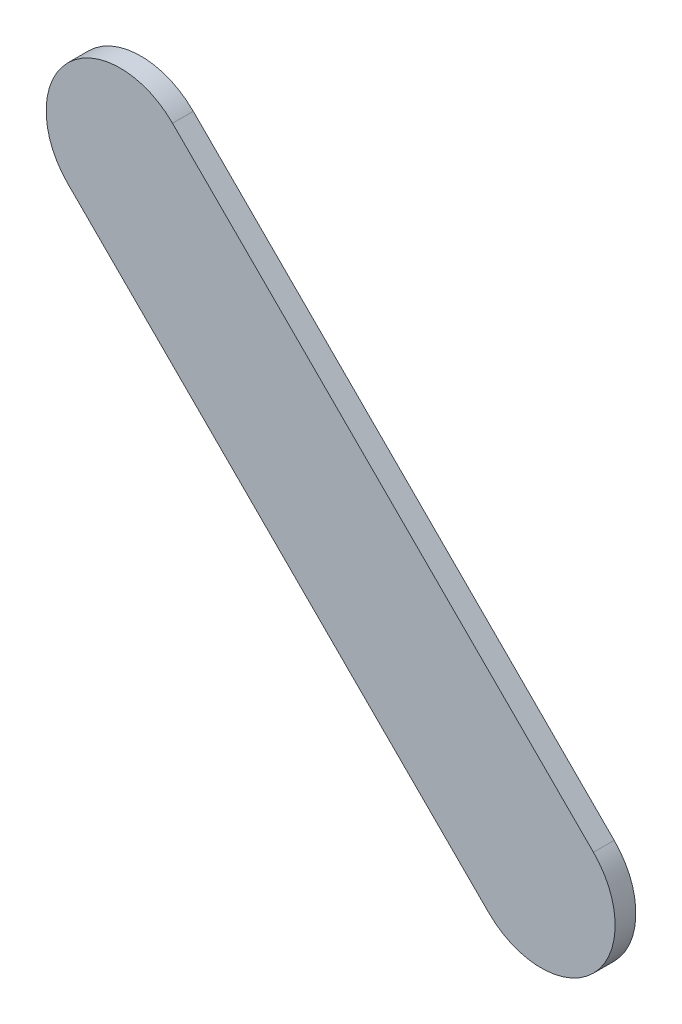
ISO-10303-21;
HEADER;
FILE_DESCRIPTION(('STEP AP214'),'2;1');
FILE_NAME('part.step','',(''),(''),'','','');
FILE_SCHEMA(('AUTOMOTIVE_DESIGN { 1 0 10303 214 1 1 1 1 }'));
ENDSEC;
DATA;
#1=APPLICATION_CONTEXT('core data for automotive mechanical design processes');
#2=APPLICATION_PROTOCOL_DEFINITION('international standard','automotive_design',2000,#1);
#3=PRODUCT_CONTEXT('',#1,'mechanical');
#4=PRODUCT('Part','Part','',(#3));
#5=PRODUCT_RELATED_PRODUCT_CATEGORY('part','',(#4));
#6=PRODUCT_DEFINITION_FORMATION('','',#4);
#7=PRODUCT_DEFINITION_CONTEXT('part definition',#1,'design');
#8=PRODUCT_DEFINITION('design','',#6,#7);
#9=PRODUCT_DEFINITION_SHAPE('','',#8);
#10=(LENGTH_UNIT() NAMED_UNIT(*) SI_UNIT(.MILLI.,.METRE.));
#11=(NAMED_UNIT(*) PLANE_ANGLE_UNIT() SI_UNIT($,.RADIAN.));
#12=(NAMED_UNIT(*) SI_UNIT($,.STERADIAN.) SOLID_ANGLE_UNIT());
#13=UNCERTAINTY_MEASURE_WITH_UNIT(LENGTH_MEASURE(1.E-05),#10,'distance_accuracy_value','');
#14=(GEOMETRIC_REPRESENTATION_CONTEXT(3) GLOBAL_UNCERTAINTY_ASSIGNED_CONTEXT((#13)) GLOBAL_UNIT_ASSIGNED_CONTEXT((#10,
#11,#12)) REPRESENTATION_CONTEXT('',''));
#15=CARTESIAN_POINT('',(0.,0.,0.));
#16=DIRECTION('',(0.,0.,1.));
#17=DIRECTION('',(1.,0.,0.));
#18=AXIS2_PLACEMENT_3D('',#15,#16,#17);
#19=CARTESIAN_POINT('',(81.40515088,68.56922532,0.));
#20=DIRECTION('',(0.707106781186548,0.707106781186548,0.));
#21=DIRECTION('',(0.707106781186548,-0.707106781186548,0.));
#22=AXIS2_PLACEMENT_3D('',#19,#20,#21);
#23=PLANE('',#22);
#24=DIRECTION('',(0.707106781186548,-0.707106781186548,0.));
#25=VECTOR('',#24,1.);
#26=CARTESIAN_POINT('',(81.40515088,68.56922532,0.03556));
#27=LINE('',#26,#25);
#28=CARTESIAN_POINT('',(81.40515088,68.56922532,0.03556));
#29=VERTEX_POINT('',#28);
#30=CARTESIAN_POINT('',(82.1271535,67.8472227,0.03556));
#31=VERTEX_POINT('',#30);
#32=EDGE_CURVE('E11',#29,#31,#27,.T.);
#33=ORIENTED_EDGE('',*,*,#32,.F.);
#34=DIRECTION('',(0.,0.,1.));
#35=VECTOR('',#34,1.);
#36=CARTESIAN_POINT('',(81.40515088,68.56922532,0.));
#37=LINE('',#36,#35);
#38=CARTESIAN_POINT('',(81.40515088,68.56922532,0.));
#39=VERTEX_POINT('',#38);
#40=EDGE_CURVE('E24',#39,#29,#37,.T.);
#41=ORIENTED_EDGE('',*,*,#40,.F.);
#42=DIRECTION('',(0.707106781186548,-0.707106781186548,0.));
#43=VECTOR('',#42,1.);
#44=CARTESIAN_POINT('',(81.40515088,68.56922532,0.));
#45=LINE('',#44,#43);
#46=CARTESIAN_POINT('',(82.1271535,67.8472227,0.));
#47=VERTEX_POINT('',#46);
#48=EDGE_CURVE('E75',#39,#47,#45,.T.);
#49=ORIENTED_EDGE('',*,*,#48,.T.);
#50=DIRECTION('',(0.,0.,1.));
#51=VECTOR('',#50,1.);
#52=CARTESIAN_POINT('',(82.1271535,67.8472227,0.));
#53=LINE('',#52,#51);
#54=EDGE_CURVE('E37',#47,#31,#53,.T.);
#55=ORIENTED_EDGE('',*,*,#54,.T.);
#56=EDGE_LOOP('',(#33,#41,#49,#55));
#57=FACE_BOUND('',#56,.T.);
#58=ADVANCED_FACE('F17',(#57),#23,.F.);
#59=CARTESIAN_POINT('',(82.2169552,67.93702567,0.));
#60=DIRECTION('',(0.,0.,-1.));
#61=DIRECTION('',(-0.707101781156281,-0.707111781181459,0.));
#62=AXIS2_PLACEMENT_3D('',#59,#60,#61);
#63=CYLINDRICAL_SURFACE('',#62,0.126999680092953);
#64=CARTESIAN_POINT('',(82.2169552,67.93702567,0.03556));
#65=DIRECTION('',(0.,0.,1.));
#66=DIRECTION('',(-0.707101781156281,-0.707111781181459,0.));
#67=AXIS2_PLACEMENT_3D('',#64,#65,#66);
#68=CIRCLE('',#67,0.126999680092953);
#69=CARTESIAN_POINT('',(82.3067569,68.02682864,0.03556));
#70=VERTEX_POINT('',#69);
#71=EDGE_CURVE('E83',#31,#70,#68,.T.);
#72=ORIENTED_EDGE('',*,*,#71,.F.);
#73=ORIENTED_EDGE('',*,*,#54,.F.);
#74=CARTESIAN_POINT('',(82.2169552,67.93702567,0.));
#75=DIRECTION('',(0.,0.,1.));
#76=DIRECTION('',(-0.707101781156281,-0.707111781181459,0.));
#77=AXIS2_PLACEMENT_3D('',#74,#75,#76);
#78=CIRCLE('',#77,0.126999680092953);
#79=CARTESIAN_POINT('',(82.3067569,68.02682864,0.));
#80=VERTEX_POINT('',#79);
#81=EDGE_CURVE('E81',#47,#80,#78,.T.);
#82=ORIENTED_EDGE('',*,*,#81,.T.);
#83=DIRECTION('',(0.,0.,1.));
#84=VECTOR('',#83,1.);
#85=CARTESIAN_POINT('',(82.3067569,68.02682864,0.));
#86=LINE('',#85,#84);
#87=EDGE_CURVE('E67',#80,#70,#86,.T.);
#88=ORIENTED_EDGE('',*,*,#87,.T.);
#89=EDGE_LOOP('',(#72,#73,#82,#88));
#90=FACE_BOUND('',#89,.T.);
#91=ADVANCED_FACE('F89',(#90),#63,.T.);
#92=CARTESIAN_POINT('',(82.3067569,68.02682864,0.));
#93=DIRECTION('',(-0.707106781186548,-0.707106781186548,0.));
#94=DIRECTION('',(-0.707106781186548,0.707106781186548,0.));
#95=AXIS2_PLACEMENT_3D('',#92,#93,#94);
#96=PLANE('',#95);
#97=DIRECTION('',(-0.707106781186548,0.707106781186548,0.));
#98=VECTOR('',#97,1.);
#99=CARTESIAN_POINT('',(82.3067569,68.02682864,0.03556));
#100=LINE('',#99,#98);
#101=CARTESIAN_POINT('',(81.58475682,68.74882872,0.03556));
#102=VERTEX_POINT('',#101);
#103=EDGE_CURVE('E71',#70,#102,#100,.T.);
#104=ORIENTED_EDGE('',*,*,#103,.F.);
#105=ORIENTED_EDGE('',*,*,#87,.F.);
#106=DIRECTION('',(-0.707106781186548,0.707106781186548,0.));
#107=VECTOR('',#106,1.);
#108=CARTESIAN_POINT('',(82.3067569,68.02682864,0.));
#109=LINE('',#108,#107);
#110=CARTESIAN_POINT('',(81.58475682,68.74882872,0.));
#111=VERTEX_POINT('',#110);
#112=EDGE_CURVE('E63',#80,#111,#109,.T.);
#113=ORIENTED_EDGE('',*,*,#112,.T.);
#114=DIRECTION('',(0.,0.,1.));
#115=VECTOR('',#114,1.);
#116=CARTESIAN_POINT('',(81.58475682,68.74882872,0.));
#117=LINE('',#116,#115);
#118=EDGE_CURVE('E53',#111,#102,#117,.T.);
#119=ORIENTED_EDGE('',*,*,#118,.T.);
#120=EDGE_LOOP('',(#104,#105,#113,#119));
#121=FACE_BOUND('',#120,.T.);
#122=ADVANCED_FACE('F66',(#121),#96,.F.);
#123=CARTESIAN_POINT('',(81.49495385,68.65902702,0.));
#124=DIRECTION('',(0.,0.,-1.));
#125=DIRECTION('',(0.707111781181403,0.707101781156337,0.));
#126=AXIS2_PLACEMENT_3D('',#123,#124,#125);
#127=CYLINDRICAL_SURFACE('',#126,0.126999680092956);
#128=CARTESIAN_POINT('',(81.49495385,68.65902702,0.03556));
#129=DIRECTION('',(0.,0.,1.));
#130=DIRECTION('',(0.707111781181403,0.707101781156337,0.));
#131=AXIS2_PLACEMENT_3D('',#128,#129,#130);
#132=CIRCLE('',#131,0.126999680092956);
#133=EDGE_CURVE('E59',#102,#29,#132,.T.);
#134=ORIENTED_EDGE('',*,*,#133,.F.);
#135=ORIENTED_EDGE('',*,*,#118,.F.);
#136=CARTESIAN_POINT('',(81.49495385,68.65902702,0.));
#137=DIRECTION('',(0.,0.,1.));
#138=DIRECTION('',(0.707111781181403,0.707101781156337,0.));
#139=AXIS2_PLACEMENT_3D('',#136,#137,#138);
#140=CIRCLE('',#139,0.126999680092956);
#141=EDGE_CURVE('E57',#111,#39,#140,.T.);
#142=ORIENTED_EDGE('',*,*,#141,.T.);
#143=ORIENTED_EDGE('',*,*,#40,.T.);
#144=EDGE_LOOP('',(#134,#135,#142,#143));
#145=FACE_BOUND('',#144,.T.);
#146=ADVANCED_FACE('F55',(#145),#127,.T.);
#147=CARTESIAN_POINT('',(81.40515088,68.56922532,0.));
#148=DIRECTION('',(0.,0.,-1.));
#149=DIRECTION('',(-1.,0.,0.));
#150=AXIS2_PLACEMENT_3D('',#147,#148,#149);
#151=PLANE('',#150);
#152=ORIENTED_EDGE('',*,*,#141,.F.);
#153=ORIENTED_EDGE('',*,*,#112,.F.);
#154=ORIENTED_EDGE('',*,*,#81,.F.);
#155=ORIENTED_EDGE('',*,*,#48,.F.);
#156=EDGE_LOOP('',(#152,#153,#154,#155));
#157=FACE_BOUND('',#156,.T.);
#158=ADVANCED_FACE('F74',(#157),#151,.T.);
#159=CARTESIAN_POINT('',(81.40515088,68.56922532,0.03556));
#160=DIRECTION('',(0.,0.,-1.));
#161=DIRECTION('',(-1.,0.,0.));
#162=AXIS2_PLACEMENT_3D('',#159,#160,#161);
#163=PLANE('',#162);
#164=ORIENTED_EDGE('',*,*,#32,.T.);
#165=ORIENTED_EDGE('',*,*,#71,.T.);
#166=ORIENTED_EDGE('',*,*,#103,.T.);
#167=ORIENTED_EDGE('',*,*,#133,.T.);
#168=EDGE_LOOP('',(#164,#165,#166,#167));
#169=FACE_BOUND('',#168,.T.);
#170=ADVANCED_FACE('F91',(#169),#163,.F.);
#171=CLOSED_SHELL('',(#58,#91,#122,#146,#158,#170));
#172=MANIFOLD_SOLID_BREP('B1',#171);
#173=ADVANCED_BREP_SHAPE_REPRESENTATION('',(#18,#172),#14);
#174=SHAPE_DEFINITION_REPRESENTATION(#9,#173);
ENDSEC;
END-ISO-10303-21;
